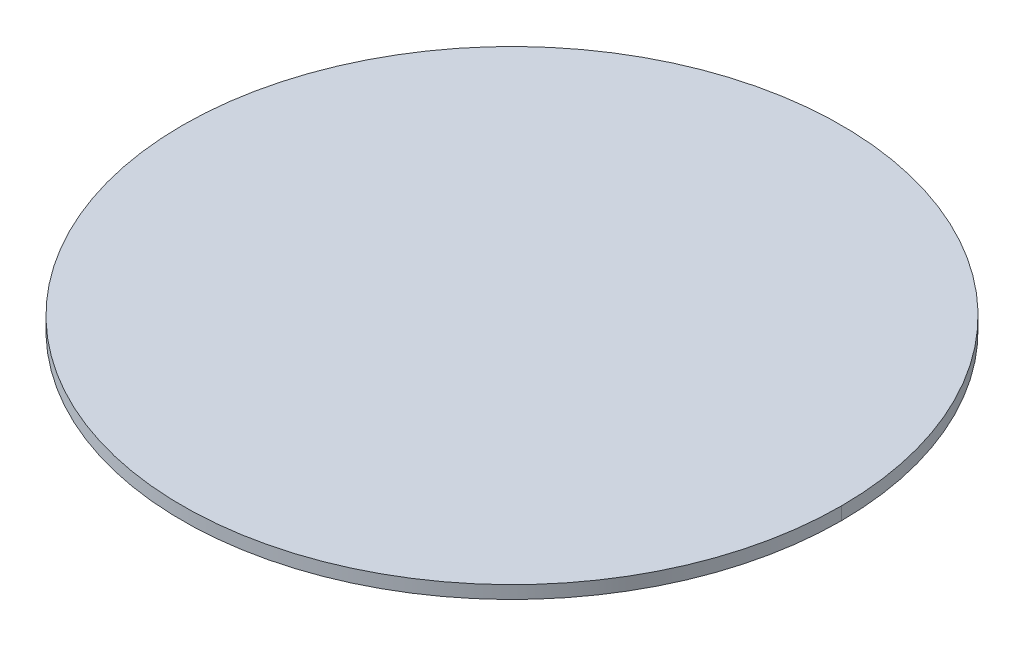
ISO-10303-21;
HEADER;
FILE_DESCRIPTION(('STEP AP214'),'2;1');
FILE_NAME('part.step','',(''),(''),'','','');
FILE_SCHEMA(('AUTOMOTIVE_DESIGN { 1 0 10303 214 1 1 1 1 }'));
ENDSEC;
DATA;
#1=APPLICATION_CONTEXT('core data for automotive mechanical design processes');
#2=APPLICATION_PROTOCOL_DEFINITION('international standard','automotive_design',2000,#1);
#3=PRODUCT_CONTEXT('',#1,'mechanical');
#4=PRODUCT('Part','Part','',(#3));
#5=PRODUCT_RELATED_PRODUCT_CATEGORY('part','',(#4));
#6=PRODUCT_DEFINITION_FORMATION('','',#4);
#7=PRODUCT_DEFINITION_CONTEXT('part definition',#1,'design');
#8=PRODUCT_DEFINITION('design','',#6,#7);
#9=PRODUCT_DEFINITION_SHAPE('','',#8);
#10=(LENGTH_UNIT() NAMED_UNIT(*) SI_UNIT(.MILLI.,.METRE.));
#11=(NAMED_UNIT(*) PLANE_ANGLE_UNIT() SI_UNIT($,.RADIAN.));
#12=(NAMED_UNIT(*) SI_UNIT($,.STERADIAN.) SOLID_ANGLE_UNIT());
#13=UNCERTAINTY_MEASURE_WITH_UNIT(LENGTH_MEASURE(1.E-05),#10,'distance_accuracy_value','');
#14=(GEOMETRIC_REPRESENTATION_CONTEXT(3) GLOBAL_UNCERTAINTY_ASSIGNED_CONTEXT((#13)) GLOBAL_UNIT_ASSIGNED_CONTEXT((#10,
#11,#12)) REPRESENTATION_CONTEXT('',''));
#15=CARTESIAN_POINT('',(0.,0.,0.));
#16=DIRECTION('',(0.,0.,1.));
#17=DIRECTION('',(1.,0.,0.));
#18=AXIS2_PLACEMENT_3D('',#15,#16,#17);
#19=CARTESIAN_POINT('',(0.,0.,0.));
#20=DIRECTION('',(0.,1.,0.));
#21=DIRECTION('',(0.,0.,1.));
#22=AXIS2_PLACEMENT_3D('',#19,#20,#21);
#23=PLANE('',#22);
#24=CARTESIAN_POINT('',(0.,0.,0.));
#25=DIRECTION('',(0.,1.,0.));
#26=DIRECTION('',(1.,0.,0.));
#27=AXIS2_PLACEMENT_3D('',#24,#25,#26);
#28=CIRCLE('',#27,3.2512);
#29=CARTESIAN_POINT('',(3.2512,0.,0.));
#30=VERTEX_POINT('',#29);
#31=CARTESIAN_POINT('',(-3.2512,0.,0.));
#32=VERTEX_POINT('',#31);
#33=EDGE_CURVE('E11',#30,#32,#28,.T.);
#34=ORIENTED_EDGE('',*,*,#33,.F.);
#35=CARTESIAN_POINT('',(0.,0.,0.));
#36=DIRECTION('',(0.,1.,0.));
#37=DIRECTION('',(1.,0.,0.));
#38=AXIS2_PLACEMENT_3D('',#35,#36,#37);
#39=CIRCLE('',#38,3.2512);
#40=EDGE_CURVE('E25',#32,#30,#39,.T.);
#41=ORIENTED_EDGE('',*,*,#40,.F.);
#42=EDGE_LOOP('',(#34,#41));
#43=FACE_BOUND('',#42,.T.);
#44=ADVANCED_FACE('F17',(#43),#23,.F.);
#45=CARTESIAN_POINT('',(0.,0.127,0.));
#46=DIRECTION('',(0.,1.,0.));
#47=DIRECTION('',(0.,0.,-1.));
#48=AXIS2_PLACEMENT_3D('',#45,#46,#47);
#49=CYLINDRICAL_SURFACE('',#48,3.2512);
#50=ORIENTED_EDGE('',*,*,#40,.T.);
#51=DIRECTION('',(0.,1.,0.));
#52=VECTOR('',#51,1.);
#53=CARTESIAN_POINT('',(3.2512,0.,0.));
#54=LINE('',#53,#52);
#55=CARTESIAN_POINT('',(3.2512,0.127,0.));
#56=VERTEX_POINT('',#55);
#57=EDGE_CURVE('E45',#30,#56,#54,.T.);
#58=ORIENTED_EDGE('',*,*,#57,.T.);
#59=CARTESIAN_POINT('',(0.,0.127,0.));
#60=DIRECTION('',(0.,1.,0.));
#61=DIRECTION('',(1.,0.,0.));
#62=AXIS2_PLACEMENT_3D('',#59,#60,#61);
#63=CIRCLE('',#62,3.2512);
#64=CARTESIAN_POINT('',(-3.2512,0.127,0.));
#65=VERTEX_POINT('',#64);
#66=EDGE_CURVE('E40',#65,#56,#63,.T.);
#67=ORIENTED_EDGE('',*,*,#66,.F.);
#68=DIRECTION('',(0.,1.,0.));
#69=VECTOR('',#68,1.);
#70=CARTESIAN_POINT('',(-3.2512,0.,0.));
#71=LINE('',#70,#69);
#72=EDGE_CURVE('E43',#32,#65,#71,.T.);
#73=ORIENTED_EDGE('',*,*,#72,.F.);
#74=EDGE_LOOP('',(#50,#58,#67,#73));
#75=FACE_BOUND('',#74,.T.);
#76=ADVANCED_FACE('F42',(#75),#49,.T.);
#77=CARTESIAN_POINT('',(0.,0.127,0.));
#78=DIRECTION('',(0.,1.,0.));
#79=DIRECTION('',(0.,0.,1.));
#80=AXIS2_PLACEMENT_3D('',#77,#78,#79);
#81=CYLINDRICAL_SURFACE('',#80,3.2512);
#82=CARTESIAN_POINT('',(0.,0.127,0.));
#83=DIRECTION('',(0.,1.,0.));
#84=DIRECTION('',(1.,0.,0.));
#85=AXIS2_PLACEMENT_3D('',#82,#83,#84);
#86=CIRCLE('',#85,3.2512);
#87=EDGE_CURVE('E52',#56,#65,#86,.T.);
#88=ORIENTED_EDGE('',*,*,#87,.F.);
#89=ORIENTED_EDGE('',*,*,#57,.F.);
#90=ORIENTED_EDGE('',*,*,#33,.T.);
#91=ORIENTED_EDGE('',*,*,#72,.T.);
#92=EDGE_LOOP('',(#88,#89,#90,#91));
#93=FACE_BOUND('',#92,.T.);
#94=ADVANCED_FACE('F51',(#93),#81,.T.);
#95=CARTESIAN_POINT('',(0.,0.127,0.));
#96=DIRECTION('',(0.,1.,0.));
#97=DIRECTION('',(0.,0.,1.));
#98=AXIS2_PLACEMENT_3D('',#95,#96,#97);
#99=PLANE('',#98);
#100=ORIENTED_EDGE('',*,*,#87,.T.);
#101=ORIENTED_EDGE('',*,*,#66,.T.);
#102=EDGE_LOOP('',(#100,#101));
#103=FACE_BOUND('',#102,.T.);
#104=ADVANCED_FACE('F54',(#103),#99,.T.);
#105=CLOSED_SHELL('',(#44,#76,#94,#104));
#106=MANIFOLD_SOLID_BREP('B1',#105);
#107=ADVANCED_BREP_SHAPE_REPRESENTATION('',(#18,#106),#14);
#108=SHAPE_DEFINITION_REPRESENTATION(#9,#107);
ENDSEC;
END-ISO-10303-21;
